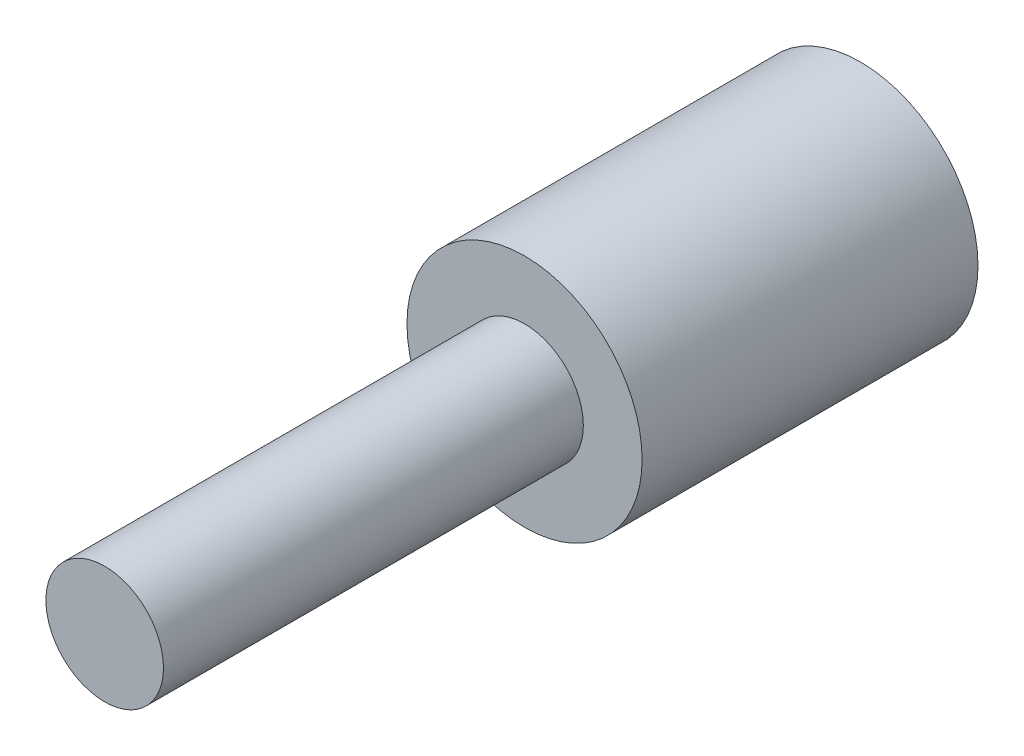
ISO-10303-21;
HEADER;
FILE_DESCRIPTION(('STEP AP214'),'2;1');
FILE_NAME('part.step','',(''),(''),'','','');
FILE_SCHEMA(('AUTOMOTIVE_DESIGN { 1 0 10303 214 1 1 1 1 }'));
ENDSEC;
DATA;
#1=APPLICATION_CONTEXT('core data for automotive mechanical design processes');
#2=APPLICATION_PROTOCOL_DEFINITION('international standard','automotive_design',2000,#1);
#3=PRODUCT_CONTEXT('',#1,'mechanical');
#4=PRODUCT('Part','Part','',(#3));
#5=PRODUCT_RELATED_PRODUCT_CATEGORY('part','',(#4));
#6=PRODUCT_DEFINITION_FORMATION('','',#4);
#7=PRODUCT_DEFINITION_CONTEXT('part definition',#1,'design');
#8=PRODUCT_DEFINITION('design','',#6,#7);
#9=PRODUCT_DEFINITION_SHAPE('','',#8);
#10=(LENGTH_UNIT() NAMED_UNIT(*) SI_UNIT(.MILLI.,.METRE.));
#11=(NAMED_UNIT(*) PLANE_ANGLE_UNIT() SI_UNIT($,.RADIAN.));
#12=(NAMED_UNIT(*) SI_UNIT($,.STERADIAN.) SOLID_ANGLE_UNIT());
#13=UNCERTAINTY_MEASURE_WITH_UNIT(LENGTH_MEASURE(1.E-05),#10,'distance_accuracy_value','');
#14=(GEOMETRIC_REPRESENTATION_CONTEXT(3) GLOBAL_UNCERTAINTY_ASSIGNED_CONTEXT((#13)) GLOBAL_UNIT_ASSIGNED_CONTEXT((#10,
#11,#12)) REPRESENTATION_CONTEXT('',''));
#15=CARTESIAN_POINT('',(0.,0.,0.));
#16=DIRECTION('',(0.,0.,1.));
#17=DIRECTION('',(1.,0.,0.));
#18=AXIS2_PLACEMENT_3D('',#15,#16,#17);
#19=CARTESIAN_POINT('',(0.,0.,0.));
#20=DIRECTION('',(0.,0.,1.));
#21=DIRECTION('',(1.,0.,0.));
#22=AXIS2_PLACEMENT_3D('',#19,#20,#21);
#23=PLANE('',#22);
#24=CARTESIAN_POINT('',(0.,0.,0.));
#25=DIRECTION('',(0.,0.,1.));
#26=DIRECTION('',(1.,0.,0.));
#27=AXIS2_PLACEMENT_3D('',#24,#25,#26);
#28=CIRCLE('',#27,4.2);
#29=CARTESIAN_POINT('',(4.2,0.,0.));
#30=VERTEX_POINT('',#29);
#31=EDGE_CURVE('E45',#30,#30,#28,.T.);
#32=ORIENTED_EDGE('',*,*,#31,.F.);
#33=EDGE_LOOP('',(#32));
#34=FACE_BOUND('',#33,.T.);
#35=CARTESIAN_POINT('',(0.,0.,0.));
#36=DIRECTION('',(0.,0.,1.));
#37=DIRECTION('',(1.,0.,0.));
#38=AXIS2_PLACEMENT_3D('',#35,#36,#37);
#39=CIRCLE('',#38,2.2);
#40=CARTESIAN_POINT('',(2.2,0.,0.));
#41=VERTEX_POINT('',#40);
#42=EDGE_CURVE('E55',#41,#41,#39,.T.);
#43=ORIENTED_EDGE('',*,*,#42,.T.);
#44=EDGE_LOOP('',(#43));
#45=FACE_BOUND('',#44,.T.);
#46=ADVANCED_FACE('F41',(#34,#45),#23,.F.);
#47=CARTESIAN_POINT('',(0.,0.,10.));
#48=DIRECTION('',(0.,0.,-1.));
#49=DIRECTION('',(-1.,0.,0.));
#50=AXIS2_PLACEMENT_3D('',#47,#48,#49);
#51=CYLINDRICAL_SURFACE('',#50,4.2);
#52=ORIENTED_EDGE('',*,*,#31,.T.);
#53=EDGE_LOOP('',(#52));
#54=FACE_BOUND('',#53,.T.);
#55=CARTESIAN_POINT('',(0.,0.,12.));
#56=DIRECTION('',(0.,0.,1.));
#57=DIRECTION('',(1.,0.,0.));
#58=AXIS2_PLACEMENT_3D('',#55,#56,#57);
#59=CIRCLE('',#58,4.2);
#60=CARTESIAN_POINT('',(4.2,0.,12.));
#61=VERTEX_POINT('',#60);
#62=EDGE_CURVE('E59',#61,#61,#59,.T.);
#63=ORIENTED_EDGE('',*,*,#62,.F.);
#64=EDGE_LOOP('',(#63));
#65=FACE_BOUND('',#64,.T.);
#66=ADVANCED_FACE('F43',(#54,#65),#51,.T.);
#67=CARTESIAN_POINT('',(0.,0.,10.));
#68=DIRECTION('',(0.,0.,-1.));
#69=DIRECTION('',(-1.,0.,0.));
#70=AXIS2_PLACEMENT_3D('',#67,#68,#69);
#71=CYLINDRICAL_SURFACE('',#70,2.2);
#72=CARTESIAN_POINT('',(0.,0.,10.));
#73=DIRECTION('',(0.,0.,1.));
#74=DIRECTION('',(1.,0.,0.));
#75=AXIS2_PLACEMENT_3D('',#72,#73,#74);
#76=CIRCLE('',#75,2.2);
#77=CARTESIAN_POINT('',(2.2,0.,10.));
#78=VERTEX_POINT('',#77);
#79=EDGE_CURVE('E63',#78,#78,#76,.T.);
#80=ORIENTED_EDGE('',*,*,#79,.T.);
#81=EDGE_LOOP('',(#80));
#82=FACE_BOUND('',#81,.T.);
#83=ORIENTED_EDGE('',*,*,#42,.F.);
#84=EDGE_LOOP('',(#83));
#85=FACE_BOUND('',#84,.T.);
#86=ADVANCED_FACE('F71',(#82,#85),#71,.F.);
#87=CARTESIAN_POINT('',(0.,0.,10.));
#88=DIRECTION('',(0.,0.,1.));
#89=DIRECTION('',(1.,0.,0.));
#90=AXIS2_PLACEMENT_3D('',#87,#88,#89);
#91=PLANE('',#90);
#92=ORIENTED_EDGE('',*,*,#79,.F.);
#93=EDGE_LOOP('',(#92));
#94=FACE_BOUND('',#93,.T.);
#95=ADVANCED_FACE('F73',(#94),#91,.F.);
#96=CARTESIAN_POINT('',(0.,0.,12.));
#97=DIRECTION('',(0.,0.,1.));
#98=DIRECTION('',(1.,0.,0.));
#99=AXIS2_PLACEMENT_3D('',#96,#97,#98);
#100=PLANE('',#99);
#101=CARTESIAN_POINT('',(0.,0.,12.));
#102=DIRECTION('',(0.,0.,1.));
#103=DIRECTION('',(1.,0.,0.));
#104=AXIS2_PLACEMENT_3D('',#101,#102,#103);
#105=CIRCLE('',#104,2.1);
#106=CARTESIAN_POINT('',(2.1,0.,12.));
#107=VERTEX_POINT('',#106);
#108=EDGE_CURVE('E10',#107,#107,#105,.T.);
#109=ORIENTED_EDGE('',*,*,#108,.F.);
#110=EDGE_LOOP('',(#109));
#111=FACE_BOUND('',#110,.T.);
#112=ORIENTED_EDGE('',*,*,#62,.T.);
#113=EDGE_LOOP('',(#112));
#114=FACE_BOUND('',#113,.T.);
#115=ADVANCED_FACE('F80',(#111,#114),#100,.T.);
#116=CARTESIAN_POINT('',(0.,0.,27.));
#117=DIRECTION('',(0.,0.,-1.));
#118=DIRECTION('',(-1.,0.,0.));
#119=AXIS2_PLACEMENT_3D('',#116,#117,#118);
#120=CYLINDRICAL_SURFACE('',#119,2.1);
#121=CARTESIAN_POINT('',(0.,0.,27.));
#122=DIRECTION('',(0.,0.,1.));
#123=DIRECTION('',(1.,0.,0.));
#124=AXIS2_PLACEMENT_3D('',#121,#122,#123);
#125=CIRCLE('',#124,2.1);
#126=CARTESIAN_POINT('',(2.1,0.,27.));
#127=VERTEX_POINT('',#126);
#128=EDGE_CURVE('E58',#127,#127,#125,.T.);
#129=ORIENTED_EDGE('',*,*,#128,.F.);
#130=EDGE_LOOP('',(#129));
#131=FACE_BOUND('',#130,.T.);
#132=ORIENTED_EDGE('',*,*,#108,.T.);
#133=EDGE_LOOP('',(#132));
#134=FACE_BOUND('',#133,.T.);
#135=ADVANCED_FACE('F93',(#131,#134),#120,.T.);
#136=CARTESIAN_POINT('',(0.,0.,27.));
#137=DIRECTION('',(0.,0.,1.));
#138=DIRECTION('',(1.,0.,0.));
#139=AXIS2_PLACEMENT_3D('',#136,#137,#138);
#140=PLANE('',#139);
#141=ORIENTED_EDGE('',*,*,#128,.T.);
#142=EDGE_LOOP('',(#141));
#143=FACE_BOUND('',#142,.T.);
#144=ADVANCED_FACE('F99',(#143),#140,.T.);
#145=CLOSED_SHELL('',(#46,#66,#86,#95,#115,#135,#144));
#146=MANIFOLD_SOLID_BREP('B2',#145);
#147=ADVANCED_BREP_SHAPE_REPRESENTATION('',(#18,#146),#14);
#148=SHAPE_DEFINITION_REPRESENTATION(#9,#147);
ENDSEC;
END-ISO-10303-21;
